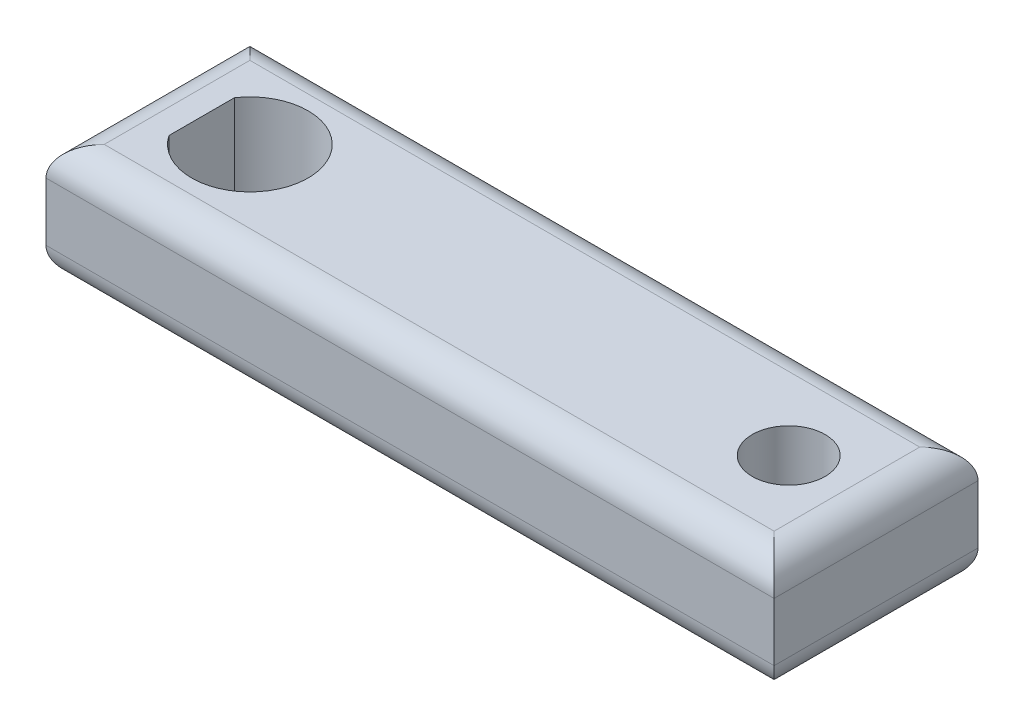
ISO-10303-21;
HEADER;
FILE_DESCRIPTION(('STEP AP214'),'2;1');
FILE_NAME('part.step','',(''),(''),'','','');
FILE_SCHEMA(('AUTOMOTIVE_DESIGN { 1 0 10303 214 1 1 1 1 }'));
ENDSEC;
DATA;
#1=APPLICATION_CONTEXT('core data for automotive mechanical design processes');
#2=APPLICATION_PROTOCOL_DEFINITION('international standard','automotive_design',2000,#1);
#3=PRODUCT_CONTEXT('',#1,'mechanical');
#4=PRODUCT('Part','Part','',(#3));
#5=PRODUCT_RELATED_PRODUCT_CATEGORY('part','',(#4));
#6=PRODUCT_DEFINITION_FORMATION('','',#4);
#7=PRODUCT_DEFINITION_CONTEXT('part definition',#1,'design');
#8=PRODUCT_DEFINITION('design','',#6,#7);
#9=PRODUCT_DEFINITION_SHAPE('','',#8);
#10=(LENGTH_UNIT() NAMED_UNIT(*) SI_UNIT(.MILLI.,.METRE.));
#11=(NAMED_UNIT(*) PLANE_ANGLE_UNIT() SI_UNIT($,.RADIAN.));
#12=(NAMED_UNIT(*) SI_UNIT($,.STERADIAN.) SOLID_ANGLE_UNIT());
#13=UNCERTAINTY_MEASURE_WITH_UNIT(LENGTH_MEASURE(1.E-05),#10,'distance_accuracy_value','');
#14=(GEOMETRIC_REPRESENTATION_CONTEXT(3) GLOBAL_UNCERTAINTY_ASSIGNED_CONTEXT((#13)) GLOBAL_UNIT_ASSIGNED_CONTEXT((#10,
#11,#12)) REPRESENTATION_CONTEXT('',''));
#15=CARTESIAN_POINT('',(0.,0.,0.));
#16=DIRECTION('',(0.,0.,1.));
#17=DIRECTION('',(1.,0.,0.));
#18=AXIS2_PLACEMENT_3D('',#15,#16,#17);
#19=CARTESIAN_POINT('',(25.,8.,-7.));
#20=DIRECTION('',(-1.,0.,0.));
#21=DIRECTION('',(0.,0.,1.));
#22=AXIS2_PLACEMENT_3D('',#19,#20,#21);
#23=PLANE('',#22);
#24=DIRECTION('',(0.,-1.,0.));
#25=VECTOR('',#24,1.);
#26=CARTESIAN_POINT('',(25.,8.,-7.));
#27=LINE('',#26,#25);
#28=CARTESIAN_POINT('',(25.,6.,-7.));
#29=VERTEX_POINT('',#28);
#30=CARTESIAN_POINT('',(25.,2.,-7.));
#31=VERTEX_POINT('',#30);
#32=EDGE_CURVE('E125',#29,#31,#27,.T.);
#33=ORIENTED_EDGE('',*,*,#32,.F.);
#34=DIRECTION('',(0.,0.,-1.));
#35=VECTOR('',#34,1.);
#36=CARTESIAN_POINT('',(25.,6.,7.));
#37=LINE('',#36,#35);
#38=CARTESIAN_POINT('',(25.,6.,7.));
#39=VERTEX_POINT('',#38);
#40=EDGE_CURVE('E154',#29,#39,#37,.F.);
#41=ORIENTED_EDGE('',*,*,#40,.T.);
#42=DIRECTION('',(0.,-1.,0.));
#43=VECTOR('',#42,1.);
#44=CARTESIAN_POINT('',(25.,8.,7.));
#45=LINE('',#44,#43);
#46=CARTESIAN_POINT('',(25.,2.,7.));
#47=VERTEX_POINT('',#46);
#48=EDGE_CURVE('E214',#39,#47,#45,.T.);
#49=ORIENTED_EDGE('',*,*,#48,.T.);
#50=DIRECTION('',(0.,0.,-1.));
#51=VECTOR('',#50,1.);
#52=CARTESIAN_POINT('',(25.,2.,-7.));
#53=LINE('',#52,#51);
#54=EDGE_CURVE('E151',#47,#31,#53,.T.);
#55=ORIENTED_EDGE('',*,*,#54,.T.);
#56=EDGE_LOOP('',(#33,#41,#49,#55));
#57=FACE_BOUND('',#56,.T.);
#58=ADVANCED_FACE('F36',(#57),#23,.F.);
#59=CARTESIAN_POINT('',(-25.,8.,-7.));
#60=DIRECTION('',(0.,0.,1.));
#61=DIRECTION('',(1.,0.,0.));
#62=AXIS2_PLACEMENT_3D('',#59,#60,#61);
#63=PLANE('',#62);
#64=DIRECTION('',(0.,-1.,0.));
#65=VECTOR('',#64,1.);
#66=CARTESIAN_POINT('',(-25.,8.,-7.));
#67=LINE('',#66,#65);
#68=CARTESIAN_POINT('',(-25.,6.,-7.));
#69=VERTEX_POINT('',#68);
#70=CARTESIAN_POINT('',(-25.,2.,-7.));
#71=VERTEX_POINT('',#70);
#72=EDGE_CURVE('E217',#69,#71,#67,.T.);
#73=ORIENTED_EDGE('',*,*,#72,.F.);
#74=DIRECTION('',(-1.,0.,0.));
#75=VECTOR('',#74,1.);
#76=CARTESIAN_POINT('',(25.,6.,-7.));
#77=LINE('',#76,#75);
#78=EDGE_CURVE('E11',#69,#29,#77,.F.);
#79=ORIENTED_EDGE('',*,*,#78,.T.);
#80=ORIENTED_EDGE('',*,*,#32,.T.);
#81=DIRECTION('',(-1.,0.,0.));
#82=VECTOR('',#81,1.);
#83=CARTESIAN_POINT('',(-25.,2.,-7.));
#84=LINE('',#83,#82);
#85=EDGE_CURVE('E45',#31,#71,#84,.T.);
#86=ORIENTED_EDGE('',*,*,#85,.T.);
#87=EDGE_LOOP('',(#73,#79,#80,#86));
#88=FACE_BOUND('',#87,.T.);
#89=ADVANCED_FACE('F215',(#88),#63,.F.);
#90=CARTESIAN_POINT('',(-25.,8.,-7.));
#91=DIRECTION('',(1.,0.,0.));
#92=DIRECTION('',(0.,0.,-1.));
#93=AXIS2_PLACEMENT_3D('',#90,#91,#92);
#94=PLANE('',#93);
#95=DIRECTION('',(0.,-1.,0.));
#96=VECTOR('',#95,1.);
#97=CARTESIAN_POINT('',(-25.,8.,7.));
#98=LINE('',#97,#96);
#99=CARTESIAN_POINT('',(-25.,6.,7.));
#100=VERTEX_POINT('',#99);
#101=CARTESIAN_POINT('',(-25.,2.,7.));
#102=VERTEX_POINT('',#101);
#103=EDGE_CURVE('E218',#100,#102,#98,.T.);
#104=ORIENTED_EDGE('',*,*,#103,.F.);
#105=DIRECTION('',(0.,0.,1.));
#106=VECTOR('',#105,1.);
#107=CARTESIAN_POINT('',(-25.,6.,-7.));
#108=LINE('',#107,#106);
#109=EDGE_CURVE('E59',#100,#69,#108,.F.);
#110=ORIENTED_EDGE('',*,*,#109,.T.);
#111=ORIENTED_EDGE('',*,*,#72,.T.);
#112=DIRECTION('',(0.,0.,1.));
#113=VECTOR('',#112,1.);
#114=CARTESIAN_POINT('',(-25.,2.,-7.));
#115=LINE('',#114,#113);
#116=EDGE_CURVE('E166',#71,#102,#115,.T.);
#117=ORIENTED_EDGE('',*,*,#116,.T.);
#118=EDGE_LOOP('',(#104,#110,#111,#117));
#119=FACE_BOUND('',#118,.T.);
#120=ADVANCED_FACE('F240',(#119),#94,.F.);
#121=CARTESIAN_POINT('',(-25.,8.,7.));
#122=DIRECTION('',(0.,0.,-1.));
#123=DIRECTION('',(-1.,0.,0.));
#124=AXIS2_PLACEMENT_3D('',#121,#122,#123);
#125=PLANE('',#124);
#126=ORIENTED_EDGE('',*,*,#48,.F.);
#127=DIRECTION('',(1.,0.,0.));
#128=VECTOR('',#127,1.);
#129=CARTESIAN_POINT('',(-25.,6.,7.));
#130=LINE('',#129,#128);
#131=EDGE_CURVE('E171',#39,#100,#130,.F.);
#132=ORIENTED_EDGE('',*,*,#131,.T.);
#133=ORIENTED_EDGE('',*,*,#103,.T.);
#134=DIRECTION('',(1.,0.,0.));
#135=VECTOR('',#134,1.);
#136=CARTESIAN_POINT('',(-25.,2.,7.));
#137=LINE('',#136,#135);
#138=EDGE_CURVE('E169',#102,#47,#137,.T.);
#139=ORIENTED_EDGE('',*,*,#138,.T.);
#140=EDGE_LOOP('',(#126,#132,#133,#139));
#141=FACE_BOUND('',#140,.T.);
#142=ADVANCED_FACE('F232',(#141),#125,.F.);
#143=CARTESIAN_POINT('',(0.,8.,0.));
#144=DIRECTION('',(0.,1.,0.));
#145=DIRECTION('',(0.,0.,1.));
#146=AXIS2_PLACEMENT_3D('',#143,#144,#145);
#147=PLANE('',#146);
#148=DIRECTION('',(0.,0.,1.));
#149=VECTOR('',#148,1.);
#150=CARTESIAN_POINT('',(-23.,8.,7.));
#151=LINE('',#150,#149);
#152=CARTESIAN_POINT('',(-23.,8.,-5.));
#153=VERTEX_POINT('',#152);
#154=CARTESIAN_POINT('',(-23.,8.,5.));
#155=VERTEX_POINT('',#154);
#156=EDGE_CURVE('E137',#153,#155,#151,.T.);
#157=ORIENTED_EDGE('',*,*,#156,.T.);
#158=DIRECTION('',(1.,0.,0.));
#159=VECTOR('',#158,1.);
#160=CARTESIAN_POINT('',(25.,8.,5.));
#161=LINE('',#160,#159);
#162=CARTESIAN_POINT('',(23.,8.,5.));
#163=VERTEX_POINT('',#162);
#164=EDGE_CURVE('E149',#155,#163,#161,.T.);
#165=ORIENTED_EDGE('',*,*,#164,.T.);
#166=DIRECTION('',(0.,0.,-1.));
#167=VECTOR('',#166,1.);
#168=CARTESIAN_POINT('',(23.,8.,-7.));
#169=LINE('',#168,#167);
#170=CARTESIAN_POINT('',(23.,8.,-5.));
#171=VERTEX_POINT('',#170);
#172=EDGE_CURVE('E146',#163,#171,#169,.T.);
#173=ORIENTED_EDGE('',*,*,#172,.T.);
#174=DIRECTION('',(-1.,0.,0.));
#175=VECTOR('',#174,1.);
#176=CARTESIAN_POINT('',(-25.,8.,-5.));
#177=LINE('',#176,#175);
#178=EDGE_CURVE('E135',#171,#153,#177,.T.);
#179=ORIENTED_EDGE('',*,*,#178,.T.);
#180=EDGE_LOOP('',(#157,#165,#173,#179));
#181=FACE_BOUND('',#180,.T.);
#182=CARTESIAN_POINT('',(19.,8.,0.));
#183=DIRECTION('',(0.,1.,0.));
#184=DIRECTION('',(0.,0.,1.));
#185=AXIS2_PLACEMENT_3D('',#182,#183,#184);
#186=CIRCLE('',#185,2.5);
#187=CARTESIAN_POINT('',(19.,8.,2.5));
#188=VERTEX_POINT('',#187);
#189=EDGE_CURVE('E143',#188,#188,#186,.T.);
#190=ORIENTED_EDGE('',*,*,#189,.F.);
#191=EDGE_LOOP('',(#190));
#192=FACE_BOUND('',#191,.T.);
#193=CARTESIAN_POINT('',(-18.,8.,0.));
#194=DIRECTION('',(0.,1.,0.));
#195=DIRECTION('',(0.,0.,1.));
#196=AXIS2_PLACEMENT_3D('',#193,#194,#195);
#197=CIRCLE('',#196,3.99999999999997);
#198=CARTESIAN_POINT('',(-21.3071891388307,8.,2.25));
#199=VERTEX_POINT('',#198);
#200=CARTESIAN_POINT('',(-21.3071891388307,8.,-2.25));
#201=VERTEX_POINT('',#200);
#202=EDGE_CURVE('E130',#199,#201,#197,.T.);
#203=ORIENTED_EDGE('',*,*,#202,.F.);
#204=DIRECTION('',(0.,0.,1.));
#205=VECTOR('',#204,1.);
#206=CARTESIAN_POINT('',(-21.3071891388307,8.,0.));
#207=LINE('',#206,#205);
#208=EDGE_CURVE('E227',#201,#199,#207,.T.);
#209=ORIENTED_EDGE('',*,*,#208,.F.);
#210=EDGE_LOOP('',(#203,#209));
#211=FACE_BOUND('',#210,.T.);
#212=ADVANCED_FACE('F230',(#181,#192,#211),#147,.T.);
#213=CARTESIAN_POINT('',(0.,0.,0.));
#214=DIRECTION('',(0.,1.,0.));
#215=DIRECTION('',(0.,0.,1.));
#216=AXIS2_PLACEMENT_3D('',#213,#214,#215);
#217=PLANE('',#216);
#218=DIRECTION('',(0.,0.,-1.));
#219=VECTOR('',#218,1.);
#220=CARTESIAN_POINT('',(23.,0.,0.));
#221=LINE('',#220,#219);
#222=CARTESIAN_POINT('',(23.,0.,-5.));
#223=VERTEX_POINT('',#222);
#224=CARTESIAN_POINT('',(23.,0.,5.));
#225=VERTEX_POINT('',#224);
#226=EDGE_CURVE('E161',#223,#225,#221,.F.);
#227=ORIENTED_EDGE('',*,*,#226,.T.);
#228=DIRECTION('',(1.,0.,0.));
#229=VECTOR('',#228,1.);
#230=CARTESIAN_POINT('',(0.,0.,5.));
#231=LINE('',#230,#229);
#232=CARTESIAN_POINT('',(-23.,0.,5.));
#233=VERTEX_POINT('',#232);
#234=EDGE_CURVE('E164',#225,#233,#231,.F.);
#235=ORIENTED_EDGE('',*,*,#234,.T.);
#236=DIRECTION('',(0.,0.,1.));
#237=VECTOR('',#236,1.);
#238=CARTESIAN_POINT('',(-23.,0.,0.));
#239=LINE('',#238,#237);
#240=CARTESIAN_POINT('',(-23.,0.,-5.));
#241=VERTEX_POINT('',#240);
#242=EDGE_CURVE('E159',#233,#241,#239,.F.);
#243=ORIENTED_EDGE('',*,*,#242,.T.);
#244=DIRECTION('',(-1.,0.,0.));
#245=VECTOR('',#244,1.);
#246=CARTESIAN_POINT('',(0.,0.,-5.));
#247=LINE('',#246,#245);
#248=EDGE_CURVE('E157',#241,#223,#247,.F.);
#249=ORIENTED_EDGE('',*,*,#248,.T.);
#250=EDGE_LOOP('',(#227,#235,#243,#249));
#251=FACE_BOUND('',#250,.T.);
#252=CARTESIAN_POINT('',(19.,0.,0.));
#253=DIRECTION('',(0.,1.,0.));
#254=DIRECTION('',(0.,0.,1.));
#255=AXIS2_PLACEMENT_3D('',#252,#253,#254);
#256=CIRCLE('',#255,2.5);
#257=CARTESIAN_POINT('',(19.,0.,2.5));
#258=VERTEX_POINT('',#257);
#259=EDGE_CURVE('E141',#258,#258,#256,.T.);
#260=ORIENTED_EDGE('',*,*,#259,.T.);
#261=EDGE_LOOP('',(#260));
#262=FACE_BOUND('',#261,.T.);
#263=DIRECTION('',(0.,0.,1.));
#264=VECTOR('',#263,1.);
#265=CARTESIAN_POINT('',(-21.3071891388307,0.,0.));
#266=LINE('',#265,#264);
#267=CARTESIAN_POINT('',(-21.3071891388307,0.,-2.25));
#268=VERTEX_POINT('',#267);
#269=CARTESIAN_POINT('',(-21.3071891388307,0.,2.25));
#270=VERTEX_POINT('',#269);
#271=EDGE_CURVE('E114',#268,#270,#266,.T.);
#272=ORIENTED_EDGE('',*,*,#271,.T.);
#273=CARTESIAN_POINT('',(-18.,0.,0.));
#274=DIRECTION('',(0.,1.,0.));
#275=DIRECTION('',(0.,0.,1.));
#276=AXIS2_PLACEMENT_3D('',#273,#274,#275);
#277=CIRCLE('',#276,3.99999999999997);
#278=EDGE_CURVE('E124',#270,#268,#277,.T.);
#279=ORIENTED_EDGE('',*,*,#278,.T.);
#280=EDGE_LOOP('',(#272,#279));
#281=FACE_BOUND('',#280,.T.);
#282=ADVANCED_FACE('F134',(#251,#262,#281),#217,.F.);
#283=CARTESIAN_POINT('',(-18.,-1.,0.));
#284=DIRECTION('',(0.,1.,0.));
#285=DIRECTION('',(0.,0.,1.));
#286=AXIS2_PLACEMENT_3D('',#283,#284,#285);
#287=CYLINDRICAL_SURFACE('',#286,3.99999999999997);
#288=ORIENTED_EDGE('',*,*,#202,.T.);
#289=DIRECTION('',(0.,1.,0.));
#290=VECTOR('',#289,1.);
#291=CARTESIAN_POINT('',(-21.3071891388307,-1.,-2.25));
#292=LINE('',#291,#290);
#293=EDGE_CURVE('E117',#268,#201,#292,.T.);
#294=ORIENTED_EDGE('',*,*,#293,.F.);
#295=ORIENTED_EDGE('',*,*,#278,.F.);
#296=DIRECTION('',(0.,1.,0.));
#297=VECTOR('',#296,1.);
#298=CARTESIAN_POINT('',(-21.3071891388307,-1.,2.25));
#299=LINE('',#298,#297);
#300=EDGE_CURVE('E120',#270,#199,#299,.T.);
#301=ORIENTED_EDGE('',*,*,#300,.T.);
#302=EDGE_LOOP('',(#288,#294,#295,#301));
#303=FACE_BOUND('',#302,.T.);
#304=ADVANCED_FACE('F128',(#303),#287,.F.);
#305=CARTESIAN_POINT('',(-21.3071891388307,-1.,-2.25));
#306=DIRECTION('',(-1.,0.,0.));
#307=DIRECTION('',(0.,0.,1.));
#308=AXIS2_PLACEMENT_3D('',#305,#306,#307);
#309=PLANE('',#308);
#310=ORIENTED_EDGE('',*,*,#208,.T.);
#311=ORIENTED_EDGE('',*,*,#300,.F.);
#312=ORIENTED_EDGE('',*,*,#271,.F.);
#313=ORIENTED_EDGE('',*,*,#293,.T.);
#314=EDGE_LOOP('',(#310,#311,#312,#313));
#315=FACE_BOUND('',#314,.T.);
#316=ADVANCED_FACE('F116',(#315),#309,.F.);
#317=CARTESIAN_POINT('',(19.,-1.,0.));
#318=DIRECTION('',(0.,1.,0.));
#319=DIRECTION('',(0.,0.,1.));
#320=AXIS2_PLACEMENT_3D('',#317,#318,#319);
#321=CYLINDRICAL_SURFACE('',#320,2.5);
#322=ORIENTED_EDGE('',*,*,#189,.T.);
#323=EDGE_LOOP('',(#322));
#324=FACE_BOUND('',#323,.T.);
#325=ORIENTED_EDGE('',*,*,#259,.F.);
#326=EDGE_LOOP('',(#325));
#327=FACE_BOUND('',#326,.T.);
#328=ADVANCED_FACE('F268',(#324,#327),#321,.F.);
#329=CARTESIAN_POINT('',(-23.,6.,0.));
#330=DIRECTION('',(0.,0.,-1.));
#331=DIRECTION('',(-1.,0.,0.));
#332=AXIS2_PLACEMENT_3D('',#329,#330,#331);
#333=CYLINDRICAL_SURFACE('',#332,2.);
#334=CARTESIAN_POINT('',(-23.,6.,-5.));
#335=DIRECTION('',(0.707106781186547,0.,-0.707106781186548));
#336=DIRECTION('',(0.707106781186548,0.,0.707106781186547));
#337=AXIS2_PLACEMENT_3D('',#334,#335,#336);
#338=ELLIPSE('',#337,2.82842712474619,2.);
#339=EDGE_CURVE('E178',#69,#153,#338,.T.);
#340=ORIENTED_EDGE('',*,*,#339,.F.);
#341=ORIENTED_EDGE('',*,*,#109,.F.);
#342=CARTESIAN_POINT('',(-23.,6.,5.));
#343=DIRECTION('',(-0.707106781186548,0.,-0.707106781186547));
#344=DIRECTION('',(-0.707106781186547,0.,0.707106781186548));
#345=AXIS2_PLACEMENT_3D('',#342,#343,#344);
#346=ELLIPSE('',#345,2.82842712474619,2.);
#347=EDGE_CURVE('E132',#155,#100,#346,.F.);
#348=ORIENTED_EDGE('',*,*,#347,.F.);
#349=ORIENTED_EDGE('',*,*,#156,.F.);
#350=EDGE_LOOP('',(#340,#341,#348,#349));
#351=FACE_BOUND('',#350,.T.);
#352=ADVANCED_FACE('F264',(#351),#333,.T.);
#353=CARTESIAN_POINT('',(0.,6.,5.));
#354=DIRECTION('',(-1.,0.,0.));
#355=DIRECTION('',(0.,0.,1.));
#356=AXIS2_PLACEMENT_3D('',#353,#354,#355);
#357=CYLINDRICAL_SURFACE('',#356,2.);
#358=ORIENTED_EDGE('',*,*,#347,.T.);
#359=ORIENTED_EDGE('',*,*,#131,.F.);
#360=CARTESIAN_POINT('',(23.,6.,5.));
#361=DIRECTION('',(-0.707106781186547,0.,0.707106781186548));
#362=DIRECTION('',(-0.707106781186548,0.,-0.707106781186547));
#363=AXIS2_PLACEMENT_3D('',#360,#361,#362);
#364=ELLIPSE('',#363,2.82842712474619,2.);
#365=EDGE_CURVE('E176',#163,#39,#364,.F.);
#366=ORIENTED_EDGE('',*,*,#365,.F.);
#367=ORIENTED_EDGE('',*,*,#164,.F.);
#368=EDGE_LOOP('',(#358,#359,#366,#367));
#369=FACE_BOUND('',#368,.T.);
#370=ADVANCED_FACE('F260',(#369),#357,.T.);
#371=CARTESIAN_POINT('',(0.,6.,-5.));
#372=DIRECTION('',(1.,0.,0.));
#373=DIRECTION('',(0.,0.,-1.));
#374=AXIS2_PLACEMENT_3D('',#371,#372,#373);
#375=CYLINDRICAL_SURFACE('',#374,2.);
#376=ORIENTED_EDGE('',*,*,#339,.T.);
#377=ORIENTED_EDGE('',*,*,#178,.F.);
#378=CARTESIAN_POINT('',(23.,6.,-5.));
#379=DIRECTION('',(0.707106781186548,0.,0.707106781186547));
#380=DIRECTION('',(0.707106781186547,0.,-0.707106781186548));
#381=AXIS2_PLACEMENT_3D('',#378,#379,#380);
#382=ELLIPSE('',#381,2.82842712474619,2.);
#383=EDGE_CURVE('E174',#29,#171,#382,.T.);
#384=ORIENTED_EDGE('',*,*,#383,.F.);
#385=ORIENTED_EDGE('',*,*,#78,.F.);
#386=EDGE_LOOP('',(#376,#377,#384,#385));
#387=FACE_BOUND('',#386,.T.);
#388=ADVANCED_FACE('F256',(#387),#375,.T.);
#389=CARTESIAN_POINT('',(23.,6.,0.));
#390=DIRECTION('',(0.,0.,1.));
#391=DIRECTION('',(1.,0.,0.));
#392=AXIS2_PLACEMENT_3D('',#389,#390,#391);
#393=CYLINDRICAL_SURFACE('',#392,2.);
#394=ORIENTED_EDGE('',*,*,#365,.T.);
#395=ORIENTED_EDGE('',*,*,#40,.F.);
#396=ORIENTED_EDGE('',*,*,#383,.T.);
#397=ORIENTED_EDGE('',*,*,#172,.F.);
#398=EDGE_LOOP('',(#394,#395,#396,#397));
#399=FACE_BOUND('',#398,.T.);
#400=ADVANCED_FACE('F253',(#399),#393,.T.);
#401=CARTESIAN_POINT('',(-23.,2.,-7.));
#402=DIRECTION('',(0.,0.,1.));
#403=DIRECTION('',(1.,0.,0.));
#404=AXIS2_PLACEMENT_3D('',#401,#402,#403);
#405=CYLINDRICAL_SURFACE('',#404,2.);
#406=CARTESIAN_POINT('',(-23.,2.,-5.));
#407=DIRECTION('',(-0.707106781186547,0.,0.707106781186548));
#408=DIRECTION('',(-0.707106781186548,0.,-0.707106781186547));
#409=AXIS2_PLACEMENT_3D('',#406,#407,#408);
#410=ELLIPSE('',#409,2.82842712474619,2.);
#411=EDGE_CURVE('E186',#241,#71,#410,.F.);
#412=ORIENTED_EDGE('',*,*,#411,.F.);
#413=ORIENTED_EDGE('',*,*,#242,.F.);
#414=CARTESIAN_POINT('',(-23.,2.,5.));
#415=DIRECTION('',(0.707106781186548,0.,0.707106781186547));
#416=DIRECTION('',(0.707106781186547,0.,-0.707106781186548));
#417=AXIS2_PLACEMENT_3D('',#414,#415,#416);
#418=ELLIPSE('',#417,2.82842712474619,2.);
#419=EDGE_CURVE('E40',#102,#233,#418,.T.);
#420=ORIENTED_EDGE('',*,*,#419,.F.);
#421=ORIENTED_EDGE('',*,*,#116,.F.);
#422=EDGE_LOOP('',(#412,#413,#420,#421));
#423=FACE_BOUND('',#422,.T.);
#424=ADVANCED_FACE('F38',(#423),#405,.T.);
#425=CARTESIAN_POINT('',(-25.,2.,5.));
#426=DIRECTION('',(1.,0.,0.));
#427=DIRECTION('',(0.,0.,-1.));
#428=AXIS2_PLACEMENT_3D('',#425,#426,#427);
#429=CYLINDRICAL_SURFACE('',#428,2.);
#430=ORIENTED_EDGE('',*,*,#419,.T.);
#431=ORIENTED_EDGE('',*,*,#234,.F.);
#432=CARTESIAN_POINT('',(23.,2.,5.));
#433=DIRECTION('',(0.707106781186547,0.,-0.707106781186548));
#434=DIRECTION('',(0.707106781186548,0.,0.707106781186547));
#435=AXIS2_PLACEMENT_3D('',#432,#433,#434);
#436=ELLIPSE('',#435,2.82842712474619,2.);
#437=EDGE_CURVE('E185',#47,#225,#436,.T.);
#438=ORIENTED_EDGE('',*,*,#437,.F.);
#439=ORIENTED_EDGE('',*,*,#138,.F.);
#440=EDGE_LOOP('',(#430,#431,#438,#439));
#441=FACE_BOUND('',#440,.T.);
#442=ADVANCED_FACE('F196',(#441),#429,.T.);
#443=CARTESIAN_POINT('',(-25.,2.,-5.));
#444=DIRECTION('',(-1.,0.,0.));
#445=DIRECTION('',(0.,0.,1.));
#446=AXIS2_PLACEMENT_3D('',#443,#444,#445);
#447=CYLINDRICAL_SURFACE('',#446,2.);
#448=ORIENTED_EDGE('',*,*,#411,.T.);
#449=ORIENTED_EDGE('',*,*,#85,.F.);
#450=CARTESIAN_POINT('',(23.,2.,-5.));
#451=DIRECTION('',(-0.707106781186548,0.,-0.707106781186547));
#452=DIRECTION('',(-0.707106781186547,0.,0.707106781186548));
#453=AXIS2_PLACEMENT_3D('',#450,#451,#452);
#454=ELLIPSE('',#453,2.82842712474619,2.);
#455=EDGE_CURVE('E183',#223,#31,#454,.F.);
#456=ORIENTED_EDGE('',*,*,#455,.F.);
#457=ORIENTED_EDGE('',*,*,#248,.F.);
#458=EDGE_LOOP('',(#448,#449,#456,#457));
#459=FACE_BOUND('',#458,.T.);
#460=ADVANCED_FACE('F208',(#459),#447,.T.);
#461=CARTESIAN_POINT('',(23.,2.,-7.));
#462=DIRECTION('',(0.,0.,-1.));
#463=DIRECTION('',(-1.,0.,0.));
#464=AXIS2_PLACEMENT_3D('',#461,#462,#463);
#465=CYLINDRICAL_SURFACE('',#464,2.);
#466=ORIENTED_EDGE('',*,*,#437,.T.);
#467=ORIENTED_EDGE('',*,*,#226,.F.);
#468=ORIENTED_EDGE('',*,*,#455,.T.);
#469=ORIENTED_EDGE('',*,*,#54,.F.);
#470=EDGE_LOOP('',(#466,#467,#468,#469));
#471=FACE_BOUND('',#470,.T.);
#472=ADVANCED_FACE('F206',(#471),#465,.T.);
#473=CLOSED_SHELL('',(#58,#89,#120,#142,#212,#282,#304,#316,#328,#352,#370,#388,#400,#424,#442,
#460,#472));
#474=MANIFOLD_SOLID_BREP('B2',#473);
#475=ADVANCED_BREP_SHAPE_REPRESENTATION('',(#18,#474),#14);
#476=SHAPE_DEFINITION_REPRESENTATION(#9,#475);
ENDSEC;
END-ISO-10303-21;
